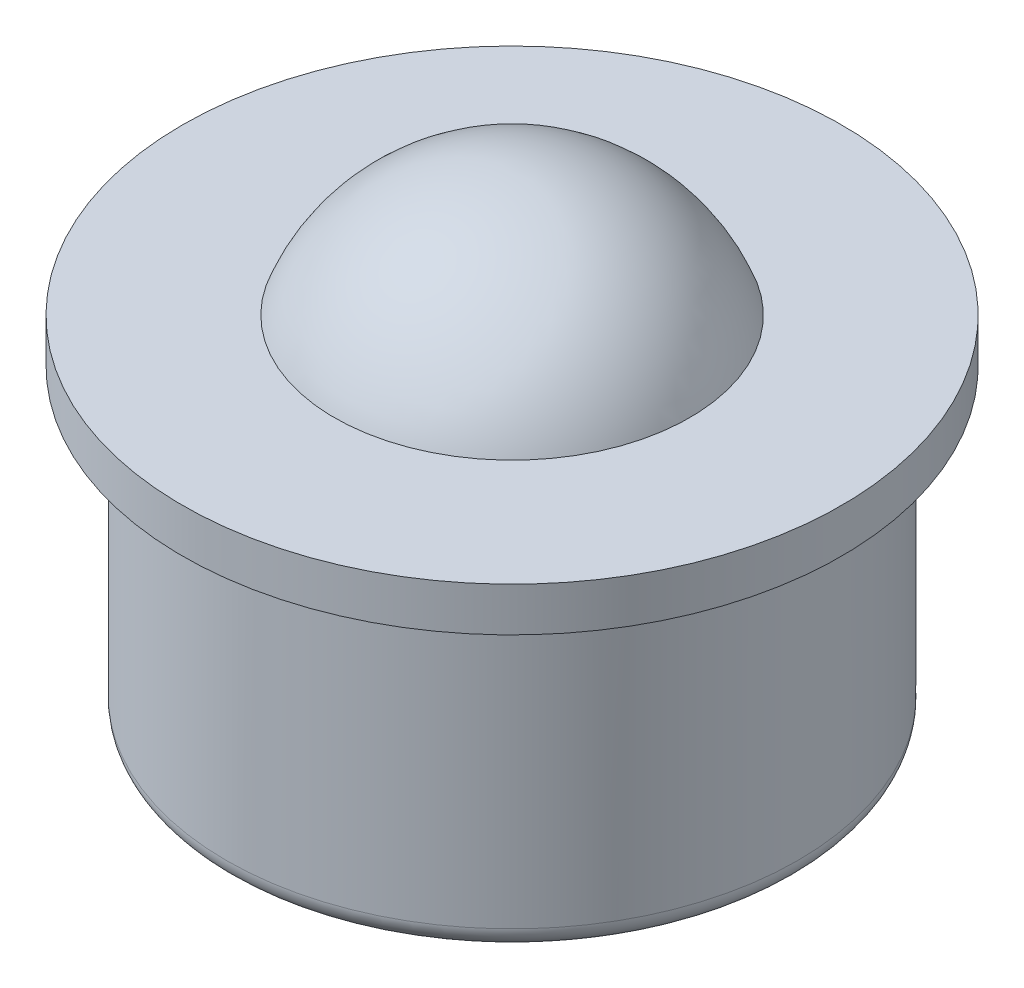
ISO-10303-21;
HEADER;
FILE_DESCRIPTION(('STEP AP214'),'2;1');
FILE_NAME('part.step','',(''),(''),'','','');
FILE_SCHEMA(('AUTOMOTIVE_DESIGN { 1 0 10303 214 1 1 1 1 }'));
ENDSEC;
DATA;
#1=APPLICATION_CONTEXT('core data for automotive mechanical design processes');
#2=APPLICATION_PROTOCOL_DEFINITION('international standard','automotive_design',2000,#1);
#3=PRODUCT_CONTEXT('',#1,'mechanical');
#4=PRODUCT('Part','Part','',(#3));
#5=PRODUCT_RELATED_PRODUCT_CATEGORY('part','',(#4));
#6=PRODUCT_DEFINITION_FORMATION('','',#4);
#7=PRODUCT_DEFINITION_CONTEXT('part definition',#1,'design');
#8=PRODUCT_DEFINITION('design','',#6,#7);
#9=PRODUCT_DEFINITION_SHAPE('','',#8);
#10=(LENGTH_UNIT() NAMED_UNIT(*) SI_UNIT(.MILLI.,.METRE.));
#11=(NAMED_UNIT(*) PLANE_ANGLE_UNIT() SI_UNIT($,.RADIAN.));
#12=(NAMED_UNIT(*) SI_UNIT($,.STERADIAN.) SOLID_ANGLE_UNIT());
#13=UNCERTAINTY_MEASURE_WITH_UNIT(LENGTH_MEASURE(1.E-05),#10,'distance_accuracy_value','');
#14=(GEOMETRIC_REPRESENTATION_CONTEXT(3) GLOBAL_UNCERTAINTY_ASSIGNED_CONTEXT((#13)) GLOBAL_UNIT_ASSIGNED_CONTEXT((#10,
#11,#12)) REPRESENTATION_CONTEXT('',''));
#15=CARTESIAN_POINT('',(0.,0.,0.));
#16=DIRECTION('',(0.,0.,1.));
#17=DIRECTION('',(1.,0.,0.));
#18=AXIS2_PLACEMENT_3D('',#15,#16,#17);
#19=CARTESIAN_POINT('',(0.,7.3,0.));
#20=DIRECTION('',(0.,1.,0.));
#21=DIRECTION('',(-1.,0.,0.));
#22=AXIS2_PLACEMENT_3D('',#19,#20,#21);
#23=CYLINDRICAL_SURFACE('',#22,6.5);
#24=CARTESIAN_POINT('',(0.,-3.,0.));
#25=DIRECTION('',(0.,-1.,0.));
#26=DIRECTION('',(1.,0.,0.));
#27=AXIS2_PLACEMENT_3D('',#24,#25,#26);
#28=CIRCLE('',#27,6.5);
#29=CARTESIAN_POINT('',(6.5,-3.,0.));
#30=VERTEX_POINT('',#29);
#31=EDGE_CURVE('E45',#30,#30,#28,.F.);
#32=ORIENTED_EDGE('',*,*,#31,.T.);
#33=EDGE_LOOP('',(#32));
#34=FACE_BOUND('',#33,.T.);
#35=CARTESIAN_POINT('',(0.,3.5,0.));
#36=DIRECTION('',(0.,1.,0.));
#37=DIRECTION('',(-1.,0.,0.));
#38=AXIS2_PLACEMENT_3D('',#35,#36,#37);
#39=CIRCLE('',#38,6.5);
#40=CARTESIAN_POINT('',(-6.5,3.5,0.));
#41=VERTEX_POINT('',#40);
#42=EDGE_CURVE('E65',#41,#41,#39,.T.);
#43=ORIENTED_EDGE('',*,*,#42,.F.);
#44=EDGE_LOOP('',(#43));
#45=FACE_BOUND('',#44,.T.);
#46=ADVANCED_FACE('F37',(#34,#45),#23,.T.);
#47=CARTESIAN_POINT('',(0.,-3.5,0.));
#48=DIRECTION('',(0.,-1.,0.));
#49=DIRECTION('',(1.,0.,0.));
#50=AXIS2_PLACEMENT_3D('',#47,#48,#49);
#51=PLANE('',#50);
#52=CARTESIAN_POINT('',(0.,-3.5,0.));
#53=DIRECTION('',(0.,-1.,0.));
#54=DIRECTION('',(1.,0.,0.));
#55=AXIS2_PLACEMENT_3D('',#52,#53,#54);
#56=CIRCLE('',#55,6.);
#57=CARTESIAN_POINT('',(6.,-3.5,0.));
#58=VERTEX_POINT('',#57);
#59=EDGE_CURVE('E10',#58,#58,#56,.T.);
#60=ORIENTED_EDGE('',*,*,#59,.T.);
#61=EDGE_LOOP('',(#60));
#62=FACE_BOUND('',#61,.T.);
#63=ADVANCED_FACE('F74',(#62),#51,.T.);
#64=CARTESIAN_POINT('',(0.,2.98,0.));
#65=DIRECTION('',(0.,1.,0.));
#66=DIRECTION('',(-1.,0.,0.));
#67=AXIS2_PLACEMENT_3D('',#64,#65,#66);
#68=SPHERICAL_SURFACE('',#67,4.32);
#69=CARTESIAN_POINT('',(0.,4.5,0.));
#70=DIRECTION('',(0.,1.,0.));
#71=DIRECTION('',(-1.,0.,0.));
#72=AXIS2_PLACEMENT_3D('',#69,#70,#71);
#73=CIRCLE('',#72,4.04376062595203);
#74=CARTESIAN_POINT('',(-4.04376062595203,4.5,0.));
#75=VERTEX_POINT('',#74);
#76=EDGE_CURVE('E50',#75,#75,#73,.T.);
#77=ORIENTED_EDGE('',*,*,#76,.T.);
#78=EDGE_LOOP('',(#77));
#79=FACE_BOUND('',#78,.T.);
#80=ADVANCED_FACE('F78',(#79),#68,.T.);
#81=CARTESIAN_POINT('',(-7.50000000000001,4.5,0.));
#82=DIRECTION('',(0.,1.,0.));
#83=DIRECTION('',(-1.,0.,0.));
#84=AXIS2_PLACEMENT_3D('',#81,#82,#83);
#85=PLANE('',#84);
#86=CARTESIAN_POINT('',(0.,4.5,0.));
#87=DIRECTION('',(0.,1.,0.));
#88=DIRECTION('',(-1.,0.,0.));
#89=AXIS2_PLACEMENT_3D('',#86,#87,#88);
#90=CIRCLE('',#89,7.50000000000001);
#91=CARTESIAN_POINT('',(-7.50000000000001,4.5,0.));
#92=VERTEX_POINT('',#91);
#93=EDGE_CURVE('E55',#92,#92,#90,.T.);
#94=ORIENTED_EDGE('',*,*,#93,.T.);
#95=EDGE_LOOP('',(#94));
#96=FACE_BOUND('',#95,.T.);
#97=ORIENTED_EDGE('',*,*,#76,.F.);
#98=EDGE_LOOP('',(#97));
#99=FACE_BOUND('',#98,.T.);
#100=ADVANCED_FACE('F83',(#96,#99),#85,.T.);
#101=CARTESIAN_POINT('',(0.,7.3,0.));
#102=DIRECTION('',(0.,1.,0.));
#103=DIRECTION('',(-1.,0.,0.));
#104=AXIS2_PLACEMENT_3D('',#101,#102,#103);
#105=CYLINDRICAL_SURFACE('',#104,7.50000000000001);
#106=CARTESIAN_POINT('',(0.,3.5,0.));
#107=DIRECTION('',(0.,1.,0.));
#108=DIRECTION('',(-1.,0.,0.));
#109=AXIS2_PLACEMENT_3D('',#106,#107,#108);
#110=CIRCLE('',#109,7.5);
#111=CARTESIAN_POINT('',(-7.5,3.5,0.));
#112=VERTEX_POINT('',#111);
#113=EDGE_CURVE('E61',#112,#112,#110,.T.);
#114=ORIENTED_EDGE('',*,*,#113,.T.);
#115=EDGE_LOOP('',(#114));
#116=FACE_BOUND('',#115,.T.);
#117=ORIENTED_EDGE('',*,*,#93,.F.);
#118=EDGE_LOOP('',(#117));
#119=FACE_BOUND('',#118,.T.);
#120=ADVANCED_FACE('F87',(#116,#119),#105,.T.);
#121=CARTESIAN_POINT('',(-6.50000000000001,3.5,0.));
#122=DIRECTION('',(0.,-1.,0.));
#123=DIRECTION('',(1.,0.,0.));
#124=AXIS2_PLACEMENT_3D('',#121,#122,#123);
#125=PLANE('',#124);
#126=ORIENTED_EDGE('',*,*,#42,.T.);
#127=EDGE_LOOP('',(#126));
#128=FACE_BOUND('',#127,.T.);
#129=ORIENTED_EDGE('',*,*,#113,.F.);
#130=EDGE_LOOP('',(#129));
#131=FACE_BOUND('',#130,.T.);
#132=ADVANCED_FACE('F70',(#128,#131),#125,.T.);
#133=CARTESIAN_POINT('',(0.,-3.,0.));
#134=DIRECTION('',(0.,-1.,0.));
#135=DIRECTION('',(1.,0.,0.));
#136=AXIS2_PLACEMENT_3D('',#133,#134,#135);
#137=TOROIDAL_SURFACE('',#136,6.,0.5);
#138=ORIENTED_EDGE('',*,*,#59,.F.);
#139=EDGE_LOOP('',(#138));
#140=FACE_BOUND('',#139,.T.);
#141=ORIENTED_EDGE('',*,*,#31,.F.);
#142=EDGE_LOOP('',(#141));
#143=FACE_BOUND('',#142,.T.);
#144=ADVANCED_FACE('F39',(#140,#143),#137,.T.);
#145=CLOSED_SHELL('',(#46,#63,#80,#100,#120,#132,#144));
#146=MANIFOLD_SOLID_BREP('B2',#145);
#147=ADVANCED_BREP_SHAPE_REPRESENTATION('',(#18,#146),#14);
#148=SHAPE_DEFINITION_REPRESENTATION(#9,#147);
ENDSEC;
END-ISO-10303-21;
